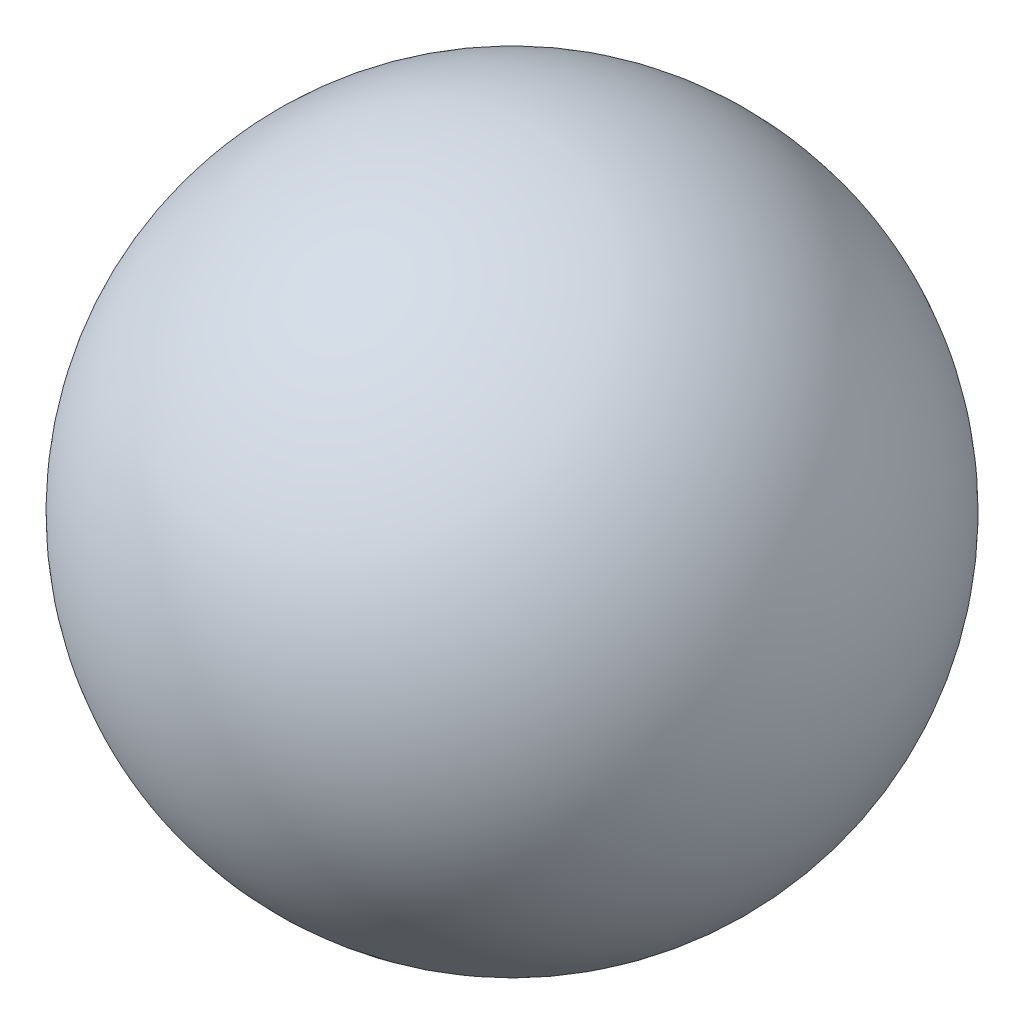
ISO-10303-21;
HEADER;
FILE_DESCRIPTION(('STEP AP214'),'2;1');
FILE_NAME('part.step','',(''),(''),'','','');
FILE_SCHEMA(('AUTOMOTIVE_DESIGN { 1 0 10303 214 1 1 1 1 }'));
ENDSEC;
DATA;
#1=APPLICATION_CONTEXT('core data for automotive mechanical design processes');
#2=APPLICATION_PROTOCOL_DEFINITION('international standard','automotive_design',2000,#1);
#3=PRODUCT_CONTEXT('',#1,'mechanical');
#4=PRODUCT('Part','Part','',(#3));
#5=PRODUCT_RELATED_PRODUCT_CATEGORY('part','',(#4));
#6=PRODUCT_DEFINITION_FORMATION('','',#4);
#7=PRODUCT_DEFINITION_CONTEXT('part definition',#1,'design');
#8=PRODUCT_DEFINITION('design','',#6,#7);
#9=PRODUCT_DEFINITION_SHAPE('','',#8);
#10=(LENGTH_UNIT() NAMED_UNIT(*) SI_UNIT(.MILLI.,.METRE.));
#11=(NAMED_UNIT(*) PLANE_ANGLE_UNIT() SI_UNIT($,.RADIAN.));
#12=(NAMED_UNIT(*) SI_UNIT($,.STERADIAN.) SOLID_ANGLE_UNIT());
#13=UNCERTAINTY_MEASURE_WITH_UNIT(LENGTH_MEASURE(1.E-05),#10,'distance_accuracy_value','');
#14=(GEOMETRIC_REPRESENTATION_CONTEXT(3) GLOBAL_UNCERTAINTY_ASSIGNED_CONTEXT((#13)) GLOBAL_UNIT_ASSIGNED_CONTEXT((#10,
#11,#12)) REPRESENTATION_CONTEXT('',''));
#15=CARTESIAN_POINT('',(0.,0.,0.));
#16=DIRECTION('',(0.,0.,1.));
#17=DIRECTION('',(1.,0.,0.));
#18=AXIS2_PLACEMENT_3D('',#15,#16,#17);
#19=CARTESIAN_POINT('',(64.16,-10.0471246789676,68.6517004500637));
#20=DIRECTION('',(0.,-0.144806720363312,0.989459960654104));
#21=DIRECTION('',(0.173648177666934,-0.974427840547316,-0.14260678090206));
#22=AXIS2_PLACEMENT_3D('',#19,#20,#21);
#23=SPHERICAL_SURFACE('',#22,7.15);
#24=CARTESIAN_POINT('',(64.16,-9.01175662836992,61.5770617313869));
#25=VERTEX_POINT('',#24);
#26=VERTEX_LOOP('',#25);
#27=FACE_BOUND('',#26,.T.);
#28=CARTESIAN_POINT('',(64.16,-11.0824927295653,75.7263391687406));
#29=VERTEX_POINT('',#28);
#30=VERTEX_LOOP('',#29);
#31=FACE_BOUND('',#30,.T.);
#32=ADVANCED_FACE('F15',(#27,#31),#23,.T.);
#33=CLOSED_SHELL('',(#32));
#34=MANIFOLD_SOLID_BREP('B1',#33);
#35=ADVANCED_BREP_SHAPE_REPRESENTATION('',(#18,#34),#14);
#36=SHAPE_DEFINITION_REPRESENTATION(#9,#35);
ENDSEC;
END-ISO-10303-21;
